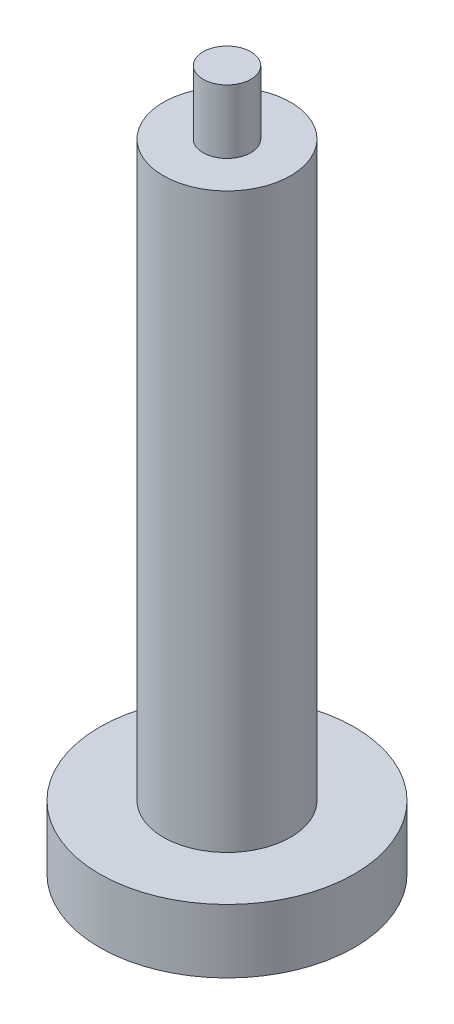
ISO-10303-21;
HEADER;
FILE_DESCRIPTION(('STEP AP214'),'2;1');
FILE_NAME('part.step','',(''),(''),'','','');
FILE_SCHEMA(('AUTOMOTIVE_DESIGN { 1 0 10303 214 1 1 1 1 }'));
ENDSEC;
DATA;
#1=APPLICATION_CONTEXT('core data for automotive mechanical design processes');
#2=APPLICATION_PROTOCOL_DEFINITION('international standard','automotive_design',2000,#1);
#3=PRODUCT_CONTEXT('',#1,'mechanical');
#4=PRODUCT('Part','Part','',(#3));
#5=PRODUCT_RELATED_PRODUCT_CATEGORY('part','',(#4));
#6=PRODUCT_DEFINITION_FORMATION('','',#4);
#7=PRODUCT_DEFINITION_CONTEXT('part definition',#1,'design');
#8=PRODUCT_DEFINITION('design','',#6,#7);
#9=PRODUCT_DEFINITION_SHAPE('','',#8);
#10=(LENGTH_UNIT() NAMED_UNIT(*) SI_UNIT(.MILLI.,.METRE.));
#11=(NAMED_UNIT(*) PLANE_ANGLE_UNIT() SI_UNIT($,.RADIAN.));
#12=(NAMED_UNIT(*) SI_UNIT($,.STERADIAN.) SOLID_ANGLE_UNIT());
#13=UNCERTAINTY_MEASURE_WITH_UNIT(LENGTH_MEASURE(1.E-05),#10,'distance_accuracy_value','');
#14=(GEOMETRIC_REPRESENTATION_CONTEXT(3) GLOBAL_UNCERTAINTY_ASSIGNED_CONTEXT((#13)) GLOBAL_UNIT_ASSIGNED_CONTEXT((#10,
#11,#12)) REPRESENTATION_CONTEXT('',''));
#15=CARTESIAN_POINT('',(0.,0.,0.));
#16=DIRECTION('',(0.,0.,1.));
#17=DIRECTION('',(1.,0.,0.));
#18=AXIS2_PLACEMENT_3D('',#15,#16,#17);
#19=CARTESIAN_POINT('',(0.,63.5,0.));
#20=DIRECTION('',(0.,1.,0.));
#21=DIRECTION('',(0.,0.,1.));
#22=AXIS2_PLACEMENT_3D('',#19,#20,#21);
#23=PLANE('',#22);
#24=CARTESIAN_POINT('',(0.,63.5,0.));
#25=DIRECTION('',(0.,1.,0.));
#26=DIRECTION('',(0.,0.,1.));
#27=AXIS2_PLACEMENT_3D('',#24,#25,#26);
#28=CIRCLE('',#27,12.7);
#29=CARTESIAN_POINT('',(0.,63.5,12.7));
#30=VERTEX_POINT('',#29);
#31=EDGE_CURVE('E71',#30,#30,#28,.T.);
#32=ORIENTED_EDGE('',*,*,#31,.T.);
#33=EDGE_LOOP('',(#32));
#34=FACE_BOUND('',#33,.T.);
#35=CARTESIAN_POINT('',(0.,63.5,0.));
#36=DIRECTION('',(0.,1.,0.));
#37=DIRECTION('',(0.,0.,1.));
#38=AXIS2_PLACEMENT_3D('',#35,#36,#37);
#39=CIRCLE('',#38,4.7625);
#40=CARTESIAN_POINT('',(0.,63.5,4.7625));
#41=VERTEX_POINT('',#40);
#42=EDGE_CURVE('E66',#41,#41,#39,.T.);
#43=ORIENTED_EDGE('',*,*,#42,.F.);
#44=EDGE_LOOP('',(#43));
#45=FACE_BOUND('',#44,.T.);
#46=ADVANCED_FACE('F36',(#34,#45),#23,.T.);
#47=CARTESIAN_POINT('',(0.,63.5,0.));
#48=DIRECTION('',(0.,-1.,0.));
#49=DIRECTION('',(0.,0.,-1.));
#50=AXIS2_PLACEMENT_3D('',#47,#48,#49);
#51=CYLINDRICAL_SURFACE('',#50,25.4);
#52=CARTESIAN_POINT('',(0.,-63.5,0.));
#53=DIRECTION('',(0.,1.,0.));
#54=DIRECTION('',(0.,0.,1.));
#55=AXIS2_PLACEMENT_3D('',#52,#53,#54);
#56=CIRCLE('',#55,25.4);
#57=CARTESIAN_POINT('',(0.,-63.5,25.4));
#58=VERTEX_POINT('',#57);
#59=EDGE_CURVE('E11',#58,#58,#56,.T.);
#60=ORIENTED_EDGE('',*,*,#59,.T.);
#61=EDGE_LOOP('',(#60));
#62=FACE_BOUND('',#61,.T.);
#63=CARTESIAN_POINT('',(0.,-50.8,0.));
#64=DIRECTION('',(0.,1.,0.));
#65=DIRECTION('',(0.,0.,1.));
#66=AXIS2_PLACEMENT_3D('',#63,#64,#65);
#67=CIRCLE('',#66,25.4);
#68=CARTESIAN_POINT('',(0.,-50.8,25.4));
#69=VERTEX_POINT('',#68);
#70=EDGE_CURVE('E43',#69,#69,#67,.T.);
#71=ORIENTED_EDGE('',*,*,#70,.F.);
#72=EDGE_LOOP('',(#71));
#73=FACE_BOUND('',#72,.T.);
#74=ADVANCED_FACE('F38',(#62,#73),#51,.T.);
#75=CARTESIAN_POINT('',(0.,-63.5,0.));
#76=DIRECTION('',(0.,1.,0.));
#77=DIRECTION('',(0.,0.,1.));
#78=AXIS2_PLACEMENT_3D('',#75,#76,#77);
#79=PLANE('',#78);
#80=CARTESIAN_POINT('',(0.,-63.5,0.));
#81=DIRECTION('',(0.,-1.,0.));
#82=DIRECTION('',(0.,0.,-1.));
#83=AXIS2_PLACEMENT_3D('',#80,#81,#82);
#84=CIRCLE('',#83,19.05);
#85=CARTESIAN_POINT('',(0.,-63.5,-19.05));
#86=VERTEX_POINT('',#85);
#87=EDGE_CURVE('E56',#86,#86,#84,.T.);
#88=ORIENTED_EDGE('',*,*,#87,.F.);
#89=EDGE_LOOP('',(#88));
#90=FACE_BOUND('',#89,.T.);
#91=ORIENTED_EDGE('',*,*,#59,.F.);
#92=EDGE_LOOP('',(#91));
#93=FACE_BOUND('',#92,.T.);
#94=ADVANCED_FACE('F84',(#90,#93),#79,.F.);
#95=CARTESIAN_POINT('',(0.,-50.8,0.));
#96=DIRECTION('',(0.,1.,0.));
#97=DIRECTION('',(0.,0.,1.));
#98=AXIS2_PLACEMENT_3D('',#95,#96,#97);
#99=PLANE('',#98);
#100=CARTESIAN_POINT('',(0.,-50.8,0.));
#101=DIRECTION('',(0.,1.,0.));
#102=DIRECTION('',(0.,0.,1.));
#103=AXIS2_PLACEMENT_3D('',#100,#101,#102);
#104=CIRCLE('',#103,12.7);
#105=CARTESIAN_POINT('',(0.,-50.8,12.7));
#106=VERTEX_POINT('',#105);
#107=EDGE_CURVE('E74',#106,#106,#104,.T.);
#108=ORIENTED_EDGE('',*,*,#107,.F.);
#109=EDGE_LOOP('',(#108));
#110=FACE_BOUND('',#109,.T.);
#111=ORIENTED_EDGE('',*,*,#70,.T.);
#112=EDGE_LOOP('',(#111));
#113=FACE_BOUND('',#112,.T.);
#114=ADVANCED_FACE('F81',(#110,#113),#99,.T.);
#115=CARTESIAN_POINT('',(0.,-50.8,0.));
#116=DIRECTION('',(0.,1.,0.));
#117=DIRECTION('',(0.,0.,1.));
#118=AXIS2_PLACEMENT_3D('',#115,#116,#117);
#119=CYLINDRICAL_SURFACE('',#118,12.7);
#120=ORIENTED_EDGE('',*,*,#107,.T.);
#121=EDGE_LOOP('',(#120));
#122=FACE_BOUND('',#121,.T.);
#123=ORIENTED_EDGE('',*,*,#31,.F.);
#124=EDGE_LOOP('',(#123));
#125=FACE_BOUND('',#124,.T.);
#126=ADVANCED_FACE('F101',(#122,#125),#119,.T.);
#127=CARTESIAN_POINT('',(0.,76.2,0.));
#128=DIRECTION('',(0.,-1.,0.));
#129=DIRECTION('',(0.,0.,-1.));
#130=AXIS2_PLACEMENT_3D('',#127,#128,#129);
#131=CYLINDRICAL_SURFACE('',#130,4.7625);
#132=CARTESIAN_POINT('',(0.,76.2,0.));
#133=DIRECTION('',(0.,1.,0.));
#134=DIRECTION('',(0.,0.,1.));
#135=AXIS2_PLACEMENT_3D('',#132,#133,#134);
#136=CIRCLE('',#135,4.7625);
#137=CARTESIAN_POINT('',(0.,76.2,4.7625));
#138=VERTEX_POINT('',#137);
#139=EDGE_CURVE('E68',#138,#138,#136,.T.);
#140=ORIENTED_EDGE('',*,*,#139,.F.);
#141=EDGE_LOOP('',(#140));
#142=FACE_BOUND('',#141,.T.);
#143=ORIENTED_EDGE('',*,*,#42,.T.);
#144=EDGE_LOOP('',(#143));
#145=FACE_BOUND('',#144,.T.);
#146=ADVANCED_FACE('F105',(#142,#145),#131,.T.);
#147=CARTESIAN_POINT('',(0.,76.2,0.));
#148=DIRECTION('',(0.,1.,0.));
#149=DIRECTION('',(0.,0.,1.));
#150=AXIS2_PLACEMENT_3D('',#147,#148,#149);
#151=PLANE('',#150);
#152=ORIENTED_EDGE('',*,*,#139,.T.);
#153=EDGE_LOOP('',(#152));
#154=FACE_BOUND('',#153,.T.);
#155=ADVANCED_FACE('F109',(#154),#151,.T.);
#156=CARTESIAN_POINT('',(0.,-60.96,0.));
#157=DIRECTION('',(0.,-1.,0.));
#158=DIRECTION('',(0.,0.,-1.));
#159=AXIS2_PLACEMENT_3D('',#156,#157,#158);
#160=CYLINDRICAL_SURFACE('',#159,19.05);
#161=CARTESIAN_POINT('',(0.,-60.96,0.));
#162=DIRECTION('',(0.,-1.,0.));
#163=DIRECTION('',(0.,0.,-1.));
#164=AXIS2_PLACEMENT_3D('',#161,#162,#163);
#165=CIRCLE('',#164,19.05);
#166=CARTESIAN_POINT('',(0.,-60.96,-19.05));
#167=VERTEX_POINT('',#166);
#168=EDGE_CURVE('E60',#167,#167,#165,.T.);
#169=ORIENTED_EDGE('',*,*,#168,.F.);
#170=EDGE_LOOP('',(#169));
#171=FACE_BOUND('',#170,.T.);
#172=ORIENTED_EDGE('',*,*,#87,.T.);
#173=EDGE_LOOP('',(#172));
#174=FACE_BOUND('',#173,.T.);
#175=ADVANCED_FACE('F113',(#171,#174),#160,.F.);
#176=CARTESIAN_POINT('',(0.,-60.96,0.));
#177=DIRECTION('',(0.,-1.,0.));
#178=DIRECTION('',(0.,0.,-1.));
#179=AXIS2_PLACEMENT_3D('',#176,#177,#178);
#180=PLANE('',#179);
#181=CARTESIAN_POINT('',(0.,-60.96,0.));
#182=DIRECTION('',(0.,-1.,0.));
#183=DIRECTION('',(0.,0.,-1.));
#184=AXIS2_PLACEMENT_3D('',#181,#182,#183);
#185=CIRCLE('',#184,3.96875);
#186=CARTESIAN_POINT('',(0.,-60.96,-3.96875));
#187=VERTEX_POINT('',#186);
#188=EDGE_CURVE('E57',#187,#187,#185,.T.);
#189=ORIENTED_EDGE('',*,*,#188,.F.);
#190=EDGE_LOOP('',(#189));
#191=FACE_BOUND('',#190,.T.);
#192=ORIENTED_EDGE('',*,*,#168,.T.);
#193=EDGE_LOOP('',(#192));
#194=FACE_BOUND('',#193,.T.);
#195=ADVANCED_FACE('F50',(#191,#194),#180,.T.);
#196=CARTESIAN_POINT('',(0.,-34.036,0.));
#197=DIRECTION('',(0.,-1.,0.));
#198=DIRECTION('',(0.,0.,-1.));
#199=AXIS2_PLACEMENT_3D('',#196,#197,#198);
#200=CONICAL_SURFACE('',#199,3.96874999999999,1.02974425867665);
#201=CARTESIAN_POINT('',(0.,-31.6513344182344,0.));
#202=VERTEX_POINT('',#201);
#203=VERTEX_LOOP('',#202);
#204=FACE_BOUND('',#203,.T.);
#205=CARTESIAN_POINT('',(0.,-34.036,0.));
#206=DIRECTION('',(0.,-1.,0.));
#207=DIRECTION('',(0.,0.,-1.));
#208=AXIS2_PLACEMENT_3D('',#205,#206,#207);
#209=CIRCLE('',#208,3.96874999999999);
#210=CARTESIAN_POINT('',(0.,-34.036,-3.96874999999999));
#211=VERTEX_POINT('',#210);
#212=EDGE_CURVE('E54',#211,#211,#209,.T.);
#213=ORIENTED_EDGE('',*,*,#212,.T.);
#214=EDGE_LOOP('',(#213));
#215=FACE_BOUND('',#214,.T.);
#216=ADVANCED_FACE('F46',(#204,#215),#200,.F.);
#217=CARTESIAN_POINT('',(0.,-60.96,0.));
#218=DIRECTION('',(0.,-1.,0.));
#219=DIRECTION('',(0.,0.,-1.));
#220=AXIS2_PLACEMENT_3D('',#217,#218,#219);
#221=CYLINDRICAL_SURFACE('',#220,3.96875);
#222=ORIENTED_EDGE('',*,*,#212,.F.);
#223=EDGE_LOOP('',(#222));
#224=FACE_BOUND('',#223,.T.);
#225=ORIENTED_EDGE('',*,*,#188,.T.);
#226=EDGE_LOOP('',(#225));
#227=FACE_BOUND('',#226,.T.);
#228=ADVANCED_FACE('F49',(#224,#227),#221,.F.);
#229=CLOSED_SHELL('',(#46,#74,#94,#114,#126,#146,#155,#175,#195,#216,#228));
#230=MANIFOLD_SOLID_BREP('B2',#229);
#231=ADVANCED_BREP_SHAPE_REPRESENTATION('',(#18,#230),#14);
#232=SHAPE_DEFINITION_REPRESENTATION(#9,#231);
ENDSEC;
END-ISO-10303-21;
